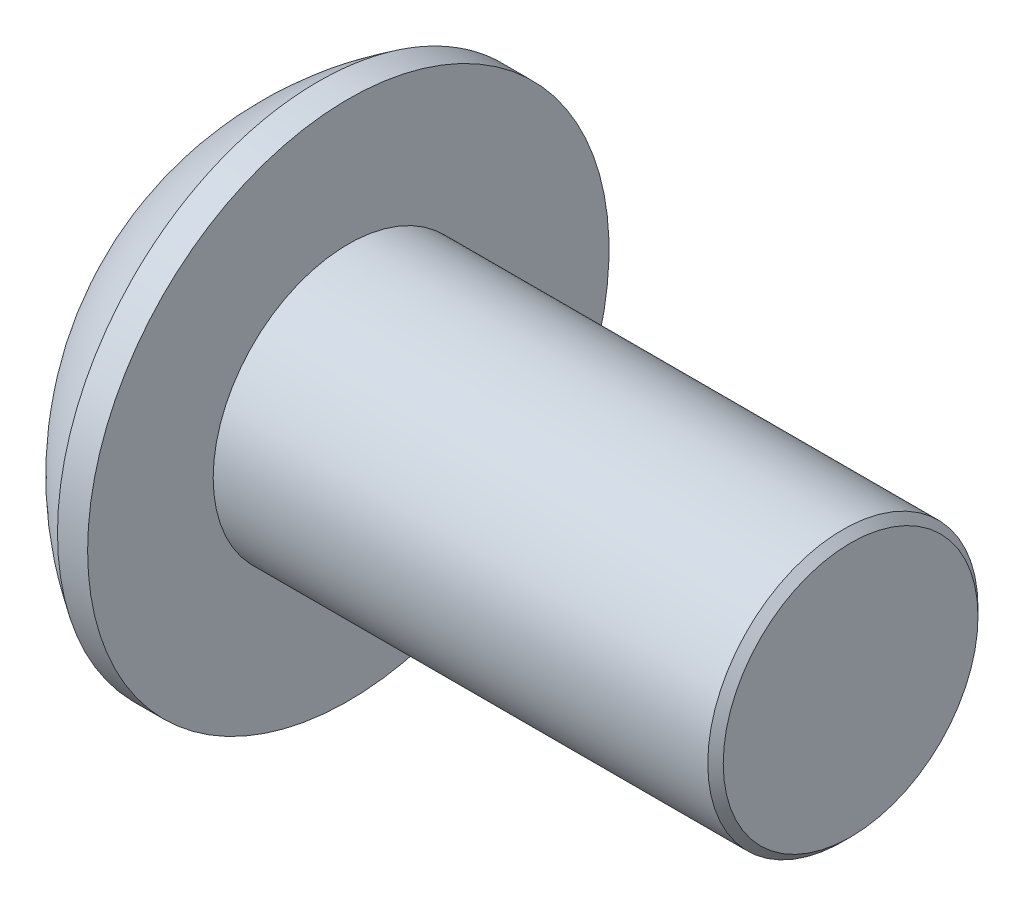
ISO-10303-21;
HEADER;
FILE_DESCRIPTION(('STEP AP214'),'2;1');
FILE_NAME('part.step','',(''),(''),'','','');
FILE_SCHEMA(('AUTOMOTIVE_DESIGN { 1 0 10303 214 1 1 1 1 }'));
ENDSEC;
DATA;
#1=APPLICATION_CONTEXT('core data for automotive mechanical design processes');
#2=APPLICATION_PROTOCOL_DEFINITION('international standard','automotive_design',2000,#1);
#3=PRODUCT_CONTEXT('',#1,'mechanical');
#4=PRODUCT('Part','Part','',(#3));
#5=PRODUCT_RELATED_PRODUCT_CATEGORY('part','',(#4));
#6=PRODUCT_DEFINITION_FORMATION('','',#4);
#7=PRODUCT_DEFINITION_CONTEXT('part definition',#1,'design');
#8=PRODUCT_DEFINITION('design','',#6,#7);
#9=PRODUCT_DEFINITION_SHAPE('','',#8);
#10=(LENGTH_UNIT() NAMED_UNIT(*) SI_UNIT(.MILLI.,.METRE.));
#11=(NAMED_UNIT(*) PLANE_ANGLE_UNIT() SI_UNIT($,.RADIAN.));
#12=(NAMED_UNIT(*) SI_UNIT($,.STERADIAN.) SOLID_ANGLE_UNIT());
#13=UNCERTAINTY_MEASURE_WITH_UNIT(LENGTH_MEASURE(1.E-05),#10,'distance_accuracy_value','');
#14=(GEOMETRIC_REPRESENTATION_CONTEXT(3) GLOBAL_UNCERTAINTY_ASSIGNED_CONTEXT((#13)) GLOBAL_UNIT_ASSIGNED_CONTEXT((#10,
#11,#12)) REPRESENTATION_CONTEXT('',''));
#15=CARTESIAN_POINT('',(0.,0.,0.));
#16=DIRECTION('',(0.,0.,1.));
#17=DIRECTION('',(1.,0.,0.));
#18=AXIS2_PLACEMENT_3D('',#15,#16,#17);
#19=CARTESIAN_POINT('',(1.32080000000034,0.,0.));
#20=DIRECTION('',(-1.,0.,0.));
#21=DIRECTION('',(0.,0.,1.));
#22=AXIS2_PLACEMENT_3D('',#19,#20,#21);
#23=CONICAL_SURFACE('',#22,1.1937999999998,1.04719755119608);
#24=CARTESIAN_POINT('',(2.01004075135902,0.,4.44089209850063E-13));
#25=VERTEX_POINT('',#24);
#26=VERTEX_LOOP('',#25);
#27=FACE_BOUND('',#26,.T.);
#28=CARTESIAN_POINT('',(1.32080000000009,0.,0.));
#29=DIRECTION('',(-1.,0.,0.));
#30=DIRECTION('',(0.,0.,1.));
#31=AXIS2_PLACEMENT_3D('',#28,#29,#30);
#32=CIRCLE('',#31,1.19380000000024);
#33=CARTESIAN_POINT('',(1.32080000000004,-1.03386112703797,0.59690000000006));
#34=VERTEX_POINT('',#33);
#35=CARTESIAN_POINT('',(1.32080000000004,0.,1.19380000000012));
#36=VERTEX_POINT('',#35);
#37=EDGE_CURVE('E20',#34,#36,#32,.T.);
#38=ORIENTED_EDGE('',*,*,#37,.T.);
#39=CARTESIAN_POINT('',(1.32080000000009,0.,0.));
#40=DIRECTION('',(-1.,0.,0.));
#41=DIRECTION('',(0.,0.,1.));
#42=AXIS2_PLACEMENT_3D('',#39,#40,#41);
#43=CIRCLE('',#42,1.19380000000024);
#44=CARTESIAN_POINT('',(1.32080000000004,1.03386112703797,0.596900000000061));
#45=VERTEX_POINT('',#44);
#46=EDGE_CURVE('E148',#36,#45,#43,.T.);
#47=ORIENTED_EDGE('',*,*,#46,.T.);
#48=CARTESIAN_POINT('',(1.32080000000009,0.,0.));
#49=DIRECTION('',(-1.,0.,0.));
#50=DIRECTION('',(0.,0.,1.));
#51=AXIS2_PLACEMENT_3D('',#48,#49,#50);
#52=CIRCLE('',#51,1.19380000000024);
#53=CARTESIAN_POINT('',(1.32080000000004,1.03386112703797,-0.596900000000061));
#54=VERTEX_POINT('',#53);
#55=EDGE_CURVE('E448',#45,#54,#52,.T.);
#56=ORIENTED_EDGE('',*,*,#55,.T.);
#57=CARTESIAN_POINT('',(1.32080000000009,0.,0.));
#58=DIRECTION('',(-1.,0.,0.));
#59=DIRECTION('',(0.,0.,1.));
#60=AXIS2_PLACEMENT_3D('',#57,#58,#59);
#61=CIRCLE('',#60,1.19380000000024);
#62=CARTESIAN_POINT('',(1.32080000000004,1.49457637585666E-12,-1.19380000000012));
#63=VERTEX_POINT('',#62);
#64=EDGE_CURVE('E449',#54,#63,#61,.T.);
#65=ORIENTED_EDGE('',*,*,#64,.T.);
#66=CARTESIAN_POINT('',(1.32080000000009,0.,0.));
#67=DIRECTION('',(-1.,0.,0.));
#68=DIRECTION('',(0.,0.,1.));
#69=AXIS2_PLACEMENT_3D('',#66,#67,#68);
#70=CIRCLE('',#69,1.19380000000024);
#71=CARTESIAN_POINT('',(1.32080000000004,-1.03386112703797,-0.59690000000006));
#72=VERTEX_POINT('',#71);
#73=EDGE_CURVE('E93',#63,#72,#70,.T.);
#74=ORIENTED_EDGE('',*,*,#73,.T.);
#75=CARTESIAN_POINT('',(1.32080000000009,0.,0.));
#76=DIRECTION('',(-1.,0.,0.));
#77=DIRECTION('',(0.,0.,1.));
#78=AXIS2_PLACEMENT_3D('',#75,#76,#77);
#79=CIRCLE('',#78,1.19380000000024);
#80=EDGE_CURVE('E89',#72,#34,#79,.T.);
#81=ORIENTED_EDGE('',*,*,#80,.T.);
#82=EDGE_LOOP('',(#38,#47,#56,#65,#74,#81));
#83=FACE_BOUND('',#82,.T.);
#84=ADVANCED_FACE('F17',(#27,#83),#23,.F.);
#85=CARTESIAN_POINT('',(1.3208,-2.06772225407572,-1.1938));
#86=DIRECTION('',(1.,0.,0.));
#87=DIRECTION('',(0.,0.,-1.));
#88=AXIS2_PLACEMENT_3D('',#85,#86,#87);
#89=PLANE('',#88);
#90=DIRECTION('',(0.,0.5,0.866025403784439));
#91=VECTOR('',#90,1.);
#92=CARTESIAN_POINT('',(1.3208,-1.37848150271715,0.));
#93=LINE('',#92,#91);
#94=CARTESIAN_POINT('',(1.3208,-0.689240751358574,1.1938));
#95=VERTEX_POINT('',#94);
#96=EDGE_CURVE('E101',#95,#34,#93,.F.);
#97=ORIENTED_EDGE('',*,*,#96,.F.);
#98=DIRECTION('',(0.,1.,0.));
#99=VECTOR('',#98,1.);
#100=CARTESIAN_POINT('',(1.3208,-0.689240751358574,1.1938));
#101=LINE('',#100,#99);
#102=EDGE_CURVE('E103',#36,#95,#101,.F.);
#103=ORIENTED_EDGE('',*,*,#102,.F.);
#104=ORIENTED_EDGE('',*,*,#37,.F.);
#105=EDGE_LOOP('',(#97,#103,#104));
#106=FACE_BOUND('',#105,.T.);
#107=ADVANCED_FACE('F99',(#106),#89,.F.);
#108=CARTESIAN_POINT('',(1.3208,-2.06772225407572,-1.1938));
#109=DIRECTION('',(1.,0.,0.));
#110=DIRECTION('',(0.,0.,-1.));
#111=AXIS2_PLACEMENT_3D('',#108,#109,#110);
#112=PLANE('',#111);
#113=DIRECTION('',(0.,-0.5,0.866025403784439));
#114=VECTOR('',#113,1.);
#115=CARTESIAN_POINT('',(1.3208,-0.689240751358574,-1.1938));
#116=LINE('',#115,#114);
#117=CARTESIAN_POINT('',(1.3208,-1.37848150271715,0.));
#118=VERTEX_POINT('',#117);
#119=EDGE_CURVE('E109',#118,#72,#116,.F.);
#120=ORIENTED_EDGE('',*,*,#119,.F.);
#121=DIRECTION('',(0.,0.5,0.866025403784439));
#122=VECTOR('',#121,1.);
#123=CARTESIAN_POINT('',(1.3208,-1.37848150271715,0.));
#124=LINE('',#123,#122);
#125=EDGE_CURVE('E106',#34,#118,#124,.F.);
#126=ORIENTED_EDGE('',*,*,#125,.F.);
#127=ORIENTED_EDGE('',*,*,#80,.F.);
#128=EDGE_LOOP('',(#120,#126,#127));
#129=FACE_BOUND('',#128,.T.);
#130=ADVANCED_FACE('F107',(#129),#112,.F.);
#131=CARTESIAN_POINT('',(1.3208,-2.06772225407572,-1.1938));
#132=DIRECTION('',(1.,0.,0.));
#133=DIRECTION('',(0.,0.,-1.));
#134=AXIS2_PLACEMENT_3D('',#131,#132,#133);
#135=PLANE('',#134);
#136=DIRECTION('',(0.,1.,0.));
#137=VECTOR('',#136,1.);
#138=CARTESIAN_POINT('',(1.3208,0.689240751358577,-1.1938));
#139=LINE('',#138,#137);
#140=CARTESIAN_POINT('',(1.3208,-0.689240751358574,-1.1938));
#141=VERTEX_POINT('',#140);
#142=EDGE_CURVE('E419',#141,#63,#139,.T.);
#143=ORIENTED_EDGE('',*,*,#142,.F.);
#144=DIRECTION('',(0.,-0.5,0.866025403784439));
#145=VECTOR('',#144,1.);
#146=CARTESIAN_POINT('',(1.3208,-0.689240751358574,-1.1938));
#147=LINE('',#146,#145);
#148=EDGE_CURVE('E431',#72,#141,#147,.F.);
#149=ORIENTED_EDGE('',*,*,#148,.F.);
#150=ORIENTED_EDGE('',*,*,#73,.F.);
#151=EDGE_LOOP('',(#143,#149,#150));
#152=FACE_BOUND('',#151,.T.);
#153=ADVANCED_FACE('F191',(#152),#135,.F.);
#154=CARTESIAN_POINT('',(1.3208,-2.06772225407572,-1.1938));
#155=DIRECTION('',(1.,0.,0.));
#156=DIRECTION('',(0.,0.,-1.));
#157=AXIS2_PLACEMENT_3D('',#154,#155,#156);
#158=PLANE('',#157);
#159=DIRECTION('',(0.,-0.5,-0.866025403784439));
#160=VECTOR('',#159,1.);
#161=CARTESIAN_POINT('',(1.3208,1.37848150271715,0.));
#162=LINE('',#161,#160);
#163=CARTESIAN_POINT('',(1.3208,0.689240751358577,-1.1938));
#164=VERTEX_POINT('',#163);
#165=EDGE_CURVE('E405',#164,#54,#162,.F.);
#166=ORIENTED_EDGE('',*,*,#165,.F.);
#167=DIRECTION('',(0.,1.,0.));
#168=VECTOR('',#167,1.);
#169=CARTESIAN_POINT('',(1.3208,0.689240751358577,-1.1938));
#170=LINE('',#169,#168);
#171=EDGE_CURVE('E416',#63,#164,#170,.T.);
#172=ORIENTED_EDGE('',*,*,#171,.F.);
#173=ORIENTED_EDGE('',*,*,#64,.F.);
#174=EDGE_LOOP('',(#166,#172,#173));
#175=FACE_BOUND('',#174,.T.);
#176=ADVANCED_FACE('F187',(#175),#158,.F.);
#177=CARTESIAN_POINT('',(1.3208,-2.06772225407572,-1.1938));
#178=DIRECTION('',(1.,0.,0.));
#179=DIRECTION('',(0.,0.,-1.));
#180=AXIS2_PLACEMENT_3D('',#177,#178,#179);
#181=PLANE('',#180);
#182=DIRECTION('',(0.,0.5,-0.866025403784439));
#183=VECTOR('',#182,1.);
#184=CARTESIAN_POINT('',(1.3208,0.689240751358576,1.1938));
#185=LINE('',#184,#183);
#186=CARTESIAN_POINT('',(1.3208,1.37848150271715,0.));
#187=VERTEX_POINT('',#186);
#188=EDGE_CURVE('E384',#187,#45,#185,.F.);
#189=ORIENTED_EDGE('',*,*,#188,.F.);
#190=DIRECTION('',(0.,-0.5,-0.866025403784439));
#191=VECTOR('',#190,1.);
#192=CARTESIAN_POINT('',(1.3208,1.37848150271715,0.));
#193=LINE('',#192,#191);
#194=EDGE_CURVE('E403',#54,#187,#193,.F.);
#195=ORIENTED_EDGE('',*,*,#194,.F.);
#196=ORIENTED_EDGE('',*,*,#55,.F.);
#197=EDGE_LOOP('',(#189,#195,#196));
#198=FACE_BOUND('',#197,.T.);
#199=ADVANCED_FACE('F183',(#198),#181,.F.);
#200=CARTESIAN_POINT('',(1.3208,-2.06772225407572,-1.1938));
#201=DIRECTION('',(1.,0.,0.));
#202=DIRECTION('',(0.,0.,-1.));
#203=AXIS2_PLACEMENT_3D('',#200,#201,#202);
#204=PLANE('',#203);
#205=DIRECTION('',(0.,1.,0.));
#206=VECTOR('',#205,1.);
#207=CARTESIAN_POINT('',(1.3208,-0.689240751358574,1.1938));
#208=LINE('',#207,#206);
#209=CARTESIAN_POINT('',(1.3208,0.689240751358576,1.1938));
#210=VERTEX_POINT('',#209);
#211=EDGE_CURVE('E118',#210,#36,#208,.F.);
#212=ORIENTED_EDGE('',*,*,#211,.F.);
#213=DIRECTION('',(0.,0.5,-0.866025403784439));
#214=VECTOR('',#213,1.);
#215=CARTESIAN_POINT('',(1.3208,0.689240751358576,1.1938));
#216=LINE('',#215,#214);
#217=EDGE_CURVE('E387',#45,#210,#216,.F.);
#218=ORIENTED_EDGE('',*,*,#217,.F.);
#219=ORIENTED_EDGE('',*,*,#46,.F.);
#220=EDGE_LOOP('',(#212,#218,#219));
#221=FACE_BOUND('',#220,.T.);
#222=ADVANCED_FACE('F179',(#221),#204,.F.);
#223=CARTESIAN_POINT('',(1.3208,-0.689240751358574,1.1938));
#224=DIRECTION('',(0.,0.,-1.));
#225=DIRECTION('',(0.,1.,0.));
#226=AXIS2_PLACEMENT_3D('',#223,#224,#225);
#227=PLANE('',#226);
#228=DIRECTION('',(0.,1.,0.));
#229=VECTOR('',#228,1.);
#230=CARTESIAN_POINT('',(0.,0.,1.1938));
#231=LINE('',#230,#229);
#232=CARTESIAN_POINT('',(0.,0.689240751358577,1.1938));
#233=VERTEX_POINT('',#232);
#234=CARTESIAN_POINT('',(0.,-0.689240751358574,1.1938));
#235=VERTEX_POINT('',#234);
#236=EDGE_CURVE('E381',#233,#235,#231,.F.);
#237=ORIENTED_EDGE('',*,*,#236,.F.);
#238=DIRECTION('',(1.,0.,0.));
#239=VECTOR('',#238,1.);
#240=CARTESIAN_POINT('',(1.3208,0.689240751358576,1.1938));
#241=LINE('',#240,#239);
#242=EDGE_CURVE('E393',#210,#233,#241,.F.);
#243=ORIENTED_EDGE('',*,*,#242,.F.);
#244=ORIENTED_EDGE('',*,*,#211,.T.);
#245=ORIENTED_EDGE('',*,*,#102,.T.);
#246=DIRECTION('',(1.,0.,0.));
#247=VECTOR('',#246,1.);
#248=CARTESIAN_POINT('',(1.3208,-0.689240751358574,1.1938));
#249=LINE('',#248,#247);
#250=EDGE_CURVE('E112',#235,#95,#249,.T.);
#251=ORIENTED_EDGE('',*,*,#250,.F.);
#252=EDGE_LOOP('',(#237,#243,#244,#245,#251));
#253=FACE_BOUND('',#252,.T.);
#254=ADVANCED_FACE('F176',(#253),#227,.T.);
#255=CARTESIAN_POINT('',(1.3208,-1.37848150271715,0.));
#256=DIRECTION('',(0.,0.866025403784439,-0.5));
#257=DIRECTION('',(0.,0.5,0.866025403784439));
#258=AXIS2_PLACEMENT_3D('',#255,#256,#257);
#259=PLANE('',#258);
#260=DIRECTION('',(0.,-0.5,-0.866025403784439));
#261=VECTOR('',#260,1.);
#262=CARTESIAN_POINT('',(0.,-0.689240751358574,1.1938));
#263=LINE('',#262,#261);
#264=CARTESIAN_POINT('',(0.,-1.37848150271715,0.));
#265=VERTEX_POINT('',#264);
#266=EDGE_CURVE('E378',#235,#265,#263,.T.);
#267=ORIENTED_EDGE('',*,*,#266,.F.);
#268=ORIENTED_EDGE('',*,*,#250,.T.);
#269=ORIENTED_EDGE('',*,*,#96,.T.);
#270=ORIENTED_EDGE('',*,*,#125,.T.);
#271=DIRECTION('',(1.,0.,0.));
#272=VECTOR('',#271,1.);
#273=CARTESIAN_POINT('',(1.3208,-1.37848150271715,0.));
#274=LINE('',#273,#272);
#275=EDGE_CURVE('E428',#265,#118,#274,.T.);
#276=ORIENTED_EDGE('',*,*,#275,.F.);
#277=EDGE_LOOP('',(#267,#268,#269,#270,#276));
#278=FACE_BOUND('',#277,.T.);
#279=ADVANCED_FACE('F116',(#278),#259,.T.);
#280=CARTESIAN_POINT('',(1.3208,-0.689240751358574,-1.1938));
#281=DIRECTION('',(0.,0.866025403784439,0.5));
#282=DIRECTION('',(0.,-0.5,0.866025403784439));
#283=AXIS2_PLACEMENT_3D('',#280,#281,#282);
#284=PLANE('',#283);
#285=DIRECTION('',(0.,0.5,-0.866025403784439));
#286=VECTOR('',#285,1.);
#287=CARTESIAN_POINT('',(0.,-1.37848150271715,0.));
#288=LINE('',#287,#286);
#289=CARTESIAN_POINT('',(0.,-0.689240751358574,-1.1938));
#290=VERTEX_POINT('',#289);
#291=EDGE_CURVE('E375',#265,#290,#288,.T.);
#292=ORIENTED_EDGE('',*,*,#291,.F.);
#293=ORIENTED_EDGE('',*,*,#275,.T.);
#294=ORIENTED_EDGE('',*,*,#119,.T.);
#295=ORIENTED_EDGE('',*,*,#148,.T.);
#296=DIRECTION('',(1.,0.,0.));
#297=VECTOR('',#296,1.);
#298=CARTESIAN_POINT('',(1.3208,-0.689240751358574,-1.1938));
#299=LINE('',#298,#297);
#300=EDGE_CURVE('E413',#290,#141,#299,.T.);
#301=ORIENTED_EDGE('',*,*,#300,.F.);
#302=EDGE_LOOP('',(#292,#293,#294,#295,#301));
#303=FACE_BOUND('',#302,.T.);
#304=ADVANCED_FACE('F169',(#303),#284,.T.);
#305=CARTESIAN_POINT('',(1.3208,0.689240751358577,-1.1938));
#306=DIRECTION('',(0.,0.,1.));
#307=DIRECTION('',(1.,0.,0.));
#308=AXIS2_PLACEMENT_3D('',#305,#306,#307);
#309=PLANE('',#308);
#310=DIRECTION('',(0.,1.,0.));
#311=VECTOR('',#310,1.);
#312=CARTESIAN_POINT('',(0.,0.,-1.1938));
#313=LINE('',#312,#311);
#314=CARTESIAN_POINT('',(0.,0.689240751358577,-1.1938));
#315=VERTEX_POINT('',#314);
#316=EDGE_CURVE('E372',#290,#315,#313,.T.);
#317=ORIENTED_EDGE('',*,*,#316,.F.);
#318=ORIENTED_EDGE('',*,*,#300,.T.);
#319=ORIENTED_EDGE('',*,*,#142,.T.);
#320=ORIENTED_EDGE('',*,*,#171,.T.);
#321=DIRECTION('',(1.,0.,0.));
#322=VECTOR('',#321,1.);
#323=CARTESIAN_POINT('',(1.3208,0.689240751358577,-1.1938));
#324=LINE('',#323,#322);
#325=EDGE_CURVE('E388',#315,#164,#324,.T.);
#326=ORIENTED_EDGE('',*,*,#325,.F.);
#327=EDGE_LOOP('',(#317,#318,#319,#320,#326));
#328=FACE_BOUND('',#327,.T.);
#329=ADVANCED_FACE('F166',(#328),#309,.T.);
#330=CARTESIAN_POINT('',(1.3208,1.37848150271715,0.));
#331=DIRECTION('',(0.,-0.866025403784439,0.5));
#332=DIRECTION('',(0.,-0.5,-0.866025403784439));
#333=AXIS2_PLACEMENT_3D('',#330,#331,#332);
#334=PLANE('',#333);
#335=DIRECTION('',(0.,0.5,0.866025403784439));
#336=VECTOR('',#335,1.);
#337=CARTESIAN_POINT('',(0.,0.689240751358577,-1.1938));
#338=LINE('',#337,#336);
#339=CARTESIAN_POINT('',(0.,1.37848150271715,0.));
#340=VERTEX_POINT('',#339);
#341=EDGE_CURVE('E369',#315,#340,#338,.T.);
#342=ORIENTED_EDGE('',*,*,#341,.F.);
#343=ORIENTED_EDGE('',*,*,#325,.T.);
#344=ORIENTED_EDGE('',*,*,#165,.T.);
#345=ORIENTED_EDGE('',*,*,#194,.T.);
#346=DIRECTION('',(1.,0.,0.));
#347=VECTOR('',#346,1.);
#348=CARTESIAN_POINT('',(1.3208,1.37848150271715,0.));
#349=LINE('',#348,#347);
#350=EDGE_CURVE('E35',#340,#187,#349,.T.);
#351=ORIENTED_EDGE('',*,*,#350,.F.);
#352=EDGE_LOOP('',(#342,#343,#344,#345,#351));
#353=FACE_BOUND('',#352,.T.);
#354=ADVANCED_FACE('F162',(#353),#334,.T.);
#355=CARTESIAN_POINT('',(1.3208,0.689240751358576,1.1938));
#356=DIRECTION('',(0.,-0.866025403784439,-0.5));
#357=DIRECTION('',(0.,0.5,-0.866025403784439));
#358=AXIS2_PLACEMENT_3D('',#355,#356,#357);
#359=PLANE('',#358);
#360=DIRECTION('',(0.,-0.5,0.866025403784439));
#361=VECTOR('',#360,1.);
#362=CARTESIAN_POINT('',(0.,1.37848150271715,0.));
#363=LINE('',#362,#361);
#364=EDGE_CURVE('E147',#340,#233,#363,.T.);
#365=ORIENTED_EDGE('',*,*,#364,.F.);
#366=ORIENTED_EDGE('',*,*,#350,.T.);
#367=ORIENTED_EDGE('',*,*,#188,.T.);
#368=ORIENTED_EDGE('',*,*,#217,.T.);
#369=ORIENTED_EDGE('',*,*,#242,.T.);
#370=EDGE_LOOP('',(#365,#366,#367,#368,#369));
#371=FACE_BOUND('',#370,.T.);
#372=ADVANCED_FACE('F158',(#371),#359,.T.);
#373=CARTESIAN_POINT('',(0.,0.,0.));
#374=DIRECTION('',(-1.,0.,0.));
#375=DIRECTION('',(0.,0.,1.));
#376=AXIS2_PLACEMENT_3D('',#373,#374,#375);
#377=PLANE('',#376);
#378=ORIENTED_EDGE('',*,*,#341,.T.);
#379=ORIENTED_EDGE('',*,*,#364,.T.);
#380=ORIENTED_EDGE('',*,*,#236,.T.);
#381=ORIENTED_EDGE('',*,*,#266,.T.);
#382=ORIENTED_EDGE('',*,*,#291,.T.);
#383=ORIENTED_EDGE('',*,*,#316,.T.);
#384=EDGE_LOOP('',(#378,#379,#380,#381,#382,#383));
#385=FACE_BOUND('',#384,.T.);
#386=CARTESIAN_POINT('',(0.,1.647825,0.));
#387=CARTESIAN_POINT('',(1.63319194702151E-13,1.64781976319874,0.092490203977753));
#388=CARTESIAN_POINT('',(1.32890083579297E-13,1.63999511633709,0.18514501432637));
#389=CARTESIAN_POINT('',(0.,1.6167119250047,0.322075808080013));
#390=CARTESIAN_POINT('',(-1.58500729597375E-13,1.60700618770234,0.36743553339636));
#391=CARTESIAN_POINT('',(1.59063479291743E-13,1.58380101865853,0.45722093569514));
#392=CARTESIAN_POINT('',(5.6924253476393E-13,1.5702985083103,0.501645823115263));
#393=CARTESIAN_POINT('',(9.37393023603841E-13,1.52428156574313,0.632817459278967));
#394=CARTESIAN_POINT('',(0.,1.48621992666366,0.717681965518643));
#395=CARTESIAN_POINT('',(0.,1.39637079695658,0.879809706624016));
#396=CARTESIAN_POINT('',(7.82184274151218E-13,1.34458278455109,0.957072652379995));
#397=CARTESIAN_POINT('',(4.86982737501784E-13,1.25777784714521,1.06558770210237));
#398=CARTESIAN_POINT('',(1.33453761487452E-13,1.22729946114794,1.10054993332365));
#399=CARTESIAN_POINT('',(-1.3289162015903E-13,1.16354004969106,1.16775237388221));
#400=CARTESIAN_POINT('',(0.,1.13026175473033,1.19999517515816));
#401=CARTESIAN_POINT('',(0.,1.02649304340867,1.29236218866442));
#402=CARTESIAN_POINT('',(0.,0.952049986714077,1.34814848277712));
#403=CARTESIAN_POINT('',(0.,0.794895196754067,1.44639825105765));
#404=CARTESIAN_POINT('',(0.,0.712183775431296,1.48886222758992));
#405=CARTESIAN_POINT('',(0.,0.540796624265731,1.55930919813143));
#406=CARTESIAN_POINT('',(0.,0.452120958135287,1.58729234680268));
#407=CARTESIAN_POINT('',(0.,0.271332331080319,1.62797191307413));
#408=CARTESIAN_POINT('',(0.,0.179219351801791,1.64066824903626));
#409=CARTESIAN_POINT('',(0.,-0.0058307702784061,1.65041748705408));
#410=CARTESIAN_POINT('',(0.,-0.0987679130800752,1.64747038910978));
#411=CARTESIAN_POINT('',(0.,-0.282830196388822,1.62601274134435));
#412=CARTESIAN_POINT('',(0.,-0.373955346570016,1.60750227463794));
#413=CARTESIAN_POINT('',(0.,-0.551796068178801,1.55545413364523));
#414=CARTESIAN_POINT('',(0.,-0.638511592498163,1.52191629885843));
#415=CARTESIAN_POINT('',(0.,-0.805120175533149,1.44072378052346));
#416=CARTESIAN_POINT('',(0.,-0.885012976819951,1.39306856461393));
#417=CARTESIAN_POINT('',(0.,-0.997912879588355,1.31211658756413));
#418=CARTESIAN_POINT('',(0.,-1.0343949246834,1.28354906167734));
#419=CARTESIAN_POINT('',(0.,-1.10486279842068,1.22341829303709));
#420=CARTESIAN_POINT('',(0.,-1.13884618403291,1.19185218578117));
#421=CARTESIAN_POINT('',(0.,-1.23657300939908,1.09305906467359));
#422=CARTESIAN_POINT('',(0.,-1.29619288399356,1.02166556658612));
#423=CARTESIAN_POINT('',(0.,-1.40258050817755,0.869876423478031));
#424=CARTESIAN_POINT('',(0.,-1.44934874627766,0.789481120793477));
#425=CARTESIAN_POINT('',(0.,-1.50889406070375,0.66387095931334));
#426=CARTESIAN_POINT('',(0.,-1.52698985473586,0.621110806760426));
#427=CARTESIAN_POINT('',(0.,-1.55950093966664,0.53426077686433));
#428=CARTESIAN_POINT('',(-1.05235362596779E-13,-1.57391920916438,0.490172008203167));
#429=CARTESIAN_POINT('',(2.10568324685354E-13,-1.61146177909579,0.356445777718595));
#430=CARTESIAN_POINT('',(1.14396658334039E-12,-1.62897899568074,0.265126085962904));
#431=CARTESIAN_POINT('',(4.347347107204E-13,-1.64174347214908,0.144386595969386));
#432=CARTESIAN_POINT('',(1.21682740895759E-13,-1.64402207668915,0.115560405797873));
#433=CARTESIAN_POINT('',(-1.21249060026839E-13,-1.6470636594012,0.0578281757252688));
#434=CARTESIAN_POINT('',(0.,-1.64782663757318,0.0289221358241775));
#435=CARTESIAN_POINT('',(1.63505268006993E-13,-1.64781976319874,-0.0924902039777536));
#436=CARTESIAN_POINT('',(1.32794566155401E-13,-1.63999511633709,-0.18514501432637));
#437=CARTESIAN_POINT('',(0.,-1.6167119250047,-0.322075808080014));
#438=CARTESIAN_POINT('',(-1.58310187784522E-13,-1.60700618770234,-0.367435533396361));
#439=CARTESIAN_POINT('',(1.58872782530651E-13,-1.58380101865853,-0.45722093569514));
#440=CARTESIAN_POINT('',(5.68527399730162E-13,-1.5702985083103,-0.501645823115263));
#441=CARTESIAN_POINT('',(9.36221934104128E-13,-1.52428156574313,-0.632817459278966));
#442=CARTESIAN_POINT('',(0.,-1.48621992666366,-0.717681965518643));
#443=CARTESIAN_POINT('',(0.,-1.39637079695658,-0.879809706624015));
#444=CARTESIAN_POINT('',(7.809853327574E-13,-1.34458278455109,-0.957072652379992));
#445=CARTESIAN_POINT('',(4.86281382838322E-13,-1.25777784714521,-1.06558770210237));
#446=CARTESIAN_POINT('',(1.33300307899813E-13,-1.22729946114794,-1.10054993332365));
#447=CARTESIAN_POINT('',(-1.32738314523763E-13,-1.16354004969107,-1.16775237388221));
#448=CARTESIAN_POINT('',(0.,-1.13026175473033,-1.19999517515816));
#449=CARTESIAN_POINT('',(0.,-1.02649304340867,-1.29236218866442));
#450=CARTESIAN_POINT('',(0.,-0.952049986714081,-1.34814848277713));
#451=CARTESIAN_POINT('',(0.,-0.794895196754072,-1.44639825105765));
#452=CARTESIAN_POINT('',(0.,-0.7121837754313,-1.48886222758991));
#453=CARTESIAN_POINT('',(0.,-0.540796624265734,-1.55930919813143));
#454=CARTESIAN_POINT('',(0.,-0.452120958135291,-1.58729234680268));
#455=CARTESIAN_POINT('',(0.,-0.271332331080322,-1.62797191307413));
#456=CARTESIAN_POINT('',(0.,-0.179219351801793,-1.64066824903626));
#457=CARTESIAN_POINT('',(0.,0.00583077027840386,-1.65041748705408));
#458=CARTESIAN_POINT('',(0.,0.0987679130800731,-1.64747038910978));
#459=CARTESIAN_POINT('',(0.,0.28283019638882,-1.62601274134436));
#460=CARTESIAN_POINT('',(0.,0.373955346570014,-1.60750227463794));
#461=CARTESIAN_POINT('',(0.,0.551796068178799,-1.55545413364523));
#462=CARTESIAN_POINT('',(0.,0.638511592498161,-1.52191629885844));
#463=CARTESIAN_POINT('',(0.,0.805120175533147,-1.44072378052347));
#464=CARTESIAN_POINT('',(0.,0.885012976819949,-1.39306856461393));
#465=CARTESIAN_POINT('',(0.,0.997912879588353,-1.31211658756413));
#466=CARTESIAN_POINT('',(0.,1.03439492468339,-1.28354906167734));
#467=CARTESIAN_POINT('',(0.,1.10486279842068,-1.22341829303709));
#468=CARTESIAN_POINT('',(0.,1.1388461840329,-1.19185218578117));
#469=CARTESIAN_POINT('',(0.,1.23657300939908,-1.09305906467358));
#470=CARTESIAN_POINT('',(0.,1.29619288399356,-1.02166556658612));
#471=CARTESIAN_POINT('',(0.,1.40258050817755,-0.869876423478032));
#472=CARTESIAN_POINT('',(0.,1.44934874627765,-0.789481120793476));
#473=CARTESIAN_POINT('',(0.,1.50889406070375,-0.66387095931334));
#474=CARTESIAN_POINT('',(0.,1.52698985473586,-0.621110806760427));
#475=CARTESIAN_POINT('',(0.,1.55950093966664,-0.534260776864331));
#476=CARTESIAN_POINT('',(-1.05163336027755E-13,1.57391920916437,-0.490172008203168));
#477=CARTESIAN_POINT('',(2.10424649207135E-13,1.61146177909579,-0.356445777718595));
#478=CARTESIAN_POINT('',(1.1439193518672E-12,1.62897899568074,-0.265126085962905));
#479=CARTESIAN_POINT('',(4.34749480231378E-13,1.64174347214908,-0.144386595969387));
#480=CARTESIAN_POINT('',(1.21707467703441E-13,1.64402207668915,-0.115560405797874));
#481=CARTESIAN_POINT('',(-1.21273786834522E-13,1.6470636594012,-0.0578281757252697));
#482=CARTESIAN_POINT('',(0.,1.64782663757318,-0.0289221358241784));
#483=CARTESIAN_POINT('',(0.,1.647825,0.));
#484=B_SPLINE_CURVE_WITH_KNOTS('',3,(#386,#387,#388,#389,#390,#391,#392,#393,#394,#395,#396,
#397,#398,#399,#400,#401,#402,#403,#404,#405,#406,#407,#408,#409,#410,#411,#412,#413,#414,#415,
#416,#417,#418,#419,#420,#421,#422,#423,#424,#425,#426,#427,#428,#429,#430,#431,#432,#433,#434,
#435,#436,#437,#438,#439,#440,#441,#442,#443,#444,#445,#446,#447,#448,#449,#450,#451,#452,#453,
#454,#455,#456,#457,#458,#459,#460,#461,#462,#463,#464,#465,#466,#467,#468,#469,#470,#471,#472,
#473,#474,#475,#476,#477,#478,#479,#480,#481,#482,#483),.UNSPECIFIED.,.T.,.F.,(4,2,2,2,2,2,2,2,
2,2,2,2,2,2,2,2,2,2,2,2,2,2,2,2,2,2,2,2,2,2,2,2,2,2,2,2,2,2,2,2,2,2,2,2,2,2,2,2,4),(0.,
0.277336029422426,0.416368541537111,0.5555141146256,0.833141970294986,1.11078038089036,
1.24978149120748,1.38864858351854,1.66629367015056,1.94392828594775,2.22155993641642,
2.49919306954937,2.77682620268234,3.05445785315101,3.3320924689482,3.6097375555799,
3.74860464789074,3.88760575820767,4.16524416880332,4.44287202447287,4.5820175975616,
4.72105010967662,4.99838613909882,5.08511046196677,5.17183478483476,5.44917081425719,
5.58820332637187,5.72734889946036,6.00497675512975,6.28261516572512,6.42161627604224,
6.5604833683533,6.83812845498532,7.11576307078251,7.39339472125118,7.67102785438413,
7.9486609875171,8.22629263798578,8.50392725378296,8.78157234041466,8.9204394327255,
9.05944054304243,9.33707895363808,9.61470680930763,9.75385238239637,9.89288489451138,
10.1702209239336,10.2569452468015,10.3436695696695),.UNSPECIFIED.);
#485=CARTESIAN_POINT('',(0.,1.647825,0.));
#486=VERTEX_POINT('',#485);
#487=EDGE_CURVE('E140',#486,#486,#484,.T.);
#488=ORIENTED_EDGE('',*,*,#487,.F.);
#489=EDGE_LOOP('',(#488));
#490=FACE_BOUND('',#489,.T.);
#491=ADVANCED_FACE('F154',(#385,#490),#377,.T.);
#492=CARTESIAN_POINT('',(3.50132362607759,0.,0.));
#493=DIRECTION('',(0.,1.,0.));
#494=DIRECTION('',(1.,0.,0.));
#495=AXIS2_PLACEMENT_3D('',#492,#493,#494);
#496=SPHERICAL_SURFACE('',#495,3.86970210289553);
#497=CARTESIAN_POINT('',(1.4732,0.,0.));
#498=DIRECTION('',(-1.,0.,0.));
#499=DIRECTION('',(0.,0.,1.));
#500=AXIS2_PLACEMENT_3D('',#497,#498,#499);
#501=CIRCLE('',#500,3.29565);
#502=CARTESIAN_POINT('',(1.4732,0.,3.29565));
#503=VERTEX_POINT('',#502);
#504=EDGE_CURVE('E137',#503,#503,#501,.F.);
#505=ORIENTED_EDGE('',*,*,#504,.F.);
#506=EDGE_LOOP('',(#505));
#507=FACE_BOUND('',#506,.T.);
#508=ORIENTED_EDGE('',*,*,#487,.T.);
#509=EDGE_LOOP('',(#508));
#510=FACE_BOUND('',#509,.T.);
#511=ADVANCED_FACE('F150',(#507,#510),#496,.T.);
#512=CARTESIAN_POINT('',(8.2042,0.,0.));
#513=DIRECTION('',(-1.,0.,0.));
#514=DIRECTION('',(0.,0.,1.));
#515=AXIS2_PLACEMENT_3D('',#512,#513,#514);
#516=PLANE('',#515);
#517=CARTESIAN_POINT('',(8.20419999996602,0.,0.));
#518=DIRECTION('',(-1.,0.,0.));
#519=DIRECTION('',(0.,0.,1.));
#520=AXIS2_PLACEMENT_3D('',#517,#518,#519);
#521=CIRCLE('',#520,1.61036000002923);
#522=CARTESIAN_POINT('',(8.20419999996602,0.,1.61036000002923));
#523=VERTEX_POINT('',#522);
#524=EDGE_CURVE('E134',#523,#523,#521,.T.);
#525=ORIENTED_EDGE('',*,*,#524,.F.);
#526=EDGE_LOOP('',(#525));
#527=FACE_BOUND('',#526,.T.);
#528=ADVANCED_FACE('F221',(#527),#516,.F.);
#529=CARTESIAN_POINT('',(0.,0.,0.));
#530=DIRECTION('',(-1.,0.,0.));
#531=DIRECTION('',(0.,0.,1.));
#532=AXIS2_PLACEMENT_3D('',#529,#530,#531);
#533=CYLINDRICAL_SURFACE('',#532,3.29565);
#534=ORIENTED_EDGE('',*,*,#504,.T.);
#535=EDGE_LOOP('',(#534));
#536=FACE_BOUND('',#535,.T.);
#537=CARTESIAN_POINT('',(1.8542,0.,0.));
#538=DIRECTION('',(-1.,0.,0.));
#539=DIRECTION('',(0.,0.,1.));
#540=AXIS2_PLACEMENT_3D('',#537,#538,#539);
#541=CIRCLE('',#540,3.29565);
#542=CARTESIAN_POINT('',(1.8542,0.,3.29565));
#543=VERTEX_POINT('',#542);
#544=EDGE_CURVE('E131',#543,#543,#541,.T.);
#545=ORIENTED_EDGE('',*,*,#544,.T.);
#546=EDGE_LOOP('',(#545));
#547=FACE_BOUND('',#546,.T.);
#548=ADVANCED_FACE('F218',(#536,#547),#533,.T.);
#549=CARTESIAN_POINT('',(8.10640999998213,0.,0.));
#550=DIRECTION('',(-1.,0.,0.));
#551=DIRECTION('',(0.,0.,1.));
#552=AXIS2_PLACEMENT_3D('',#549,#550,#551);
#553=CONICAL_SURFACE('',#552,1.70814999995628,0.785398163106808);
#554=CARTESIAN_POINT('',(8.10641,0.,0.));
#555=DIRECTION('',(-1.,0.,0.));
#556=DIRECTION('',(0.,0.,1.));
#557=AXIS2_PLACEMENT_3D('',#554,#555,#556);
#558=CIRCLE('',#557,1.70815);
#559=CARTESIAN_POINT('',(8.10641,0.,1.70815));
#560=VERTEX_POINT('',#559);
#561=EDGE_CURVE('E26',#560,#560,#558,.T.);
#562=ORIENTED_EDGE('',*,*,#561,.F.);
#563=EDGE_LOOP('',(#562));
#564=FACE_BOUND('',#563,.T.);
#565=ORIENTED_EDGE('',*,*,#524,.T.);
#566=EDGE_LOOP('',(#565));
#567=FACE_BOUND('',#566,.T.);
#568=ADVANCED_FACE('F211',(#564,#567),#553,.T.);
#569=CARTESIAN_POINT('',(1.8542,1.70815,0.));
#570=DIRECTION('',(-1.,0.,0.));
#571=DIRECTION('',(0.,0.,1.));
#572=AXIS2_PLACEMENT_3D('',#569,#570,#571);
#573=PLANE('',#572);
#574=CARTESIAN_POINT('',(1.8542,0.,0.));
#575=DIRECTION('',(-1.,0.,0.));
#576=DIRECTION('',(0.,0.,1.));
#577=AXIS2_PLACEMENT_3D('',#574,#575,#576);
#578=CIRCLE('',#577,1.70815);
#579=CARTESIAN_POINT('',(1.8542,0.,1.70815));
#580=VERTEX_POINT('',#579);
#581=EDGE_CURVE('E10',#580,#580,#578,.F.);
#582=ORIENTED_EDGE('',*,*,#581,.F.);
#583=EDGE_LOOP('',(#582));
#584=FACE_BOUND('',#583,.T.);
#585=ORIENTED_EDGE('',*,*,#544,.F.);
#586=EDGE_LOOP('',(#585));
#587=FACE_BOUND('',#586,.T.);
#588=ADVANCED_FACE('F205',(#584,#587),#573,.F.);
#589=CARTESIAN_POINT('',(0.,0.,0.));
#590=DIRECTION('',(-1.,0.,0.));
#591=DIRECTION('',(0.,0.,1.));
#592=AXIS2_PLACEMENT_3D('',#589,#590,#591);
#593=CYLINDRICAL_SURFACE('',#592,1.70815);
#594=ORIENTED_EDGE('',*,*,#581,.T.);
#595=EDGE_LOOP('',(#594));
#596=FACE_BOUND('',#595,.T.);
#597=ORIENTED_EDGE('',*,*,#561,.T.);
#598=EDGE_LOOP('',(#597));
#599=FACE_BOUND('',#598,.T.);
#600=ADVANCED_FACE('F203',(#596,#599),#593,.T.);
#601=CLOSED_SHELL('',(#84,#107,#130,#153,#176,#199,#222,#254,#279,#304,#329,#354,#372,#491,#511,
#528,#548,#568,#588,#600));
#602=MANIFOLD_SOLID_BREP('B1',#601);
#603=ADVANCED_BREP_SHAPE_REPRESENTATION('',(#18,#602),#14);
#604=SHAPE_DEFINITION_REPRESENTATION(#9,#603);
ENDSEC;
END-ISO-10303-21;
